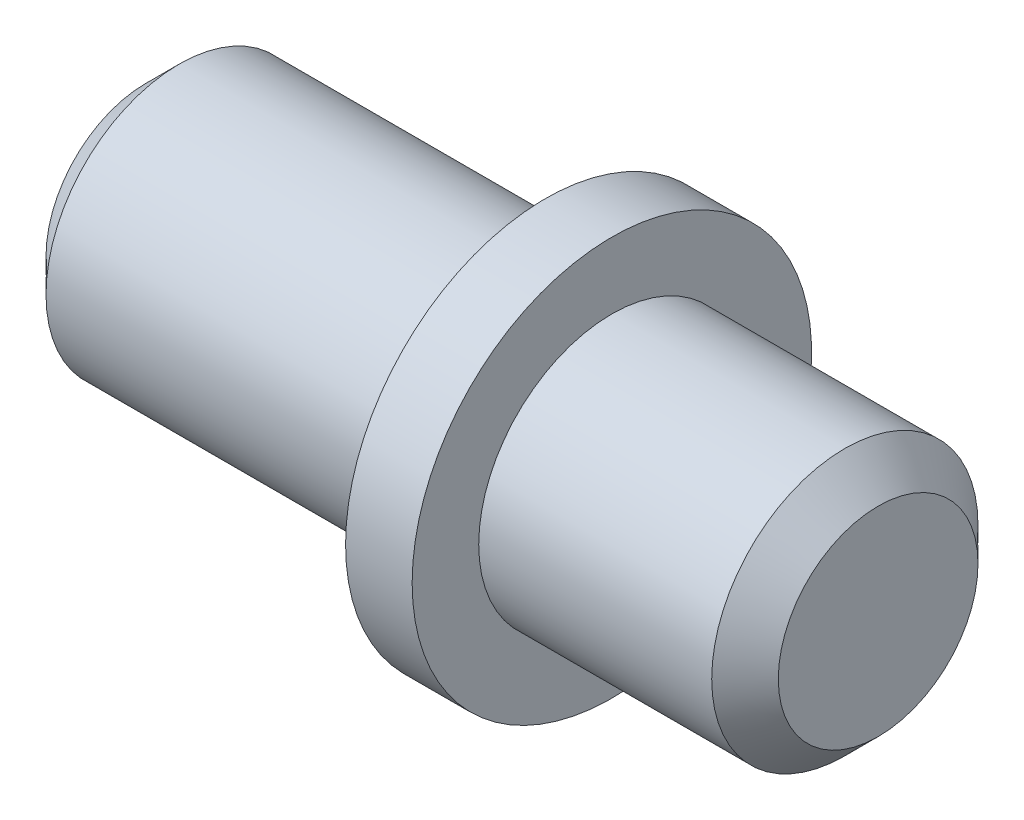
ISO-10303-21;
HEADER;
FILE_DESCRIPTION(('STEP AP214'),'2;1');
FILE_NAME('part.step','',(''),(''),'','','');
FILE_SCHEMA(('AUTOMOTIVE_DESIGN { 1 0 10303 214 1 1 1 1 }'));
ENDSEC;
DATA;
#1=APPLICATION_CONTEXT('core data for automotive mechanical design processes');
#2=APPLICATION_PROTOCOL_DEFINITION('international standard','automotive_design',2000,#1);
#3=PRODUCT_CONTEXT('',#1,'mechanical');
#4=PRODUCT('Part','Part','',(#3));
#5=PRODUCT_RELATED_PRODUCT_CATEGORY('part','',(#4));
#6=PRODUCT_DEFINITION_FORMATION('','',#4);
#7=PRODUCT_DEFINITION_CONTEXT('part definition',#1,'design');
#8=PRODUCT_DEFINITION('design','',#6,#7);
#9=PRODUCT_DEFINITION_SHAPE('','',#8);
#10=(LENGTH_UNIT() NAMED_UNIT(*) SI_UNIT(.MILLI.,.METRE.));
#11=(NAMED_UNIT(*) PLANE_ANGLE_UNIT() SI_UNIT($,.RADIAN.));
#12=(NAMED_UNIT(*) SI_UNIT($,.STERADIAN.) SOLID_ANGLE_UNIT());
#13=UNCERTAINTY_MEASURE_WITH_UNIT(LENGTH_MEASURE(1.E-05),#10,'distance_accuracy_value','');
#14=(GEOMETRIC_REPRESENTATION_CONTEXT(3) GLOBAL_UNCERTAINTY_ASSIGNED_CONTEXT((#13)) GLOBAL_UNIT_ASSIGNED_CONTEXT((#10,
#11,#12)) REPRESENTATION_CONTEXT('',''));
#15=CARTESIAN_POINT('',(0.,0.,0.));
#16=DIRECTION('',(0.,0.,1.));
#17=DIRECTION('',(1.,0.,0.));
#18=AXIS2_PLACEMENT_3D('',#15,#16,#17);
#19=CARTESIAN_POINT('',(0.,0.,0.));
#20=DIRECTION('',(-1.,0.,0.));
#21=DIRECTION('',(0.,0.,1.));
#22=AXIS2_PLACEMENT_3D('',#19,#20,#21);
#23=PLANE('',#22);
#24=CARTESIAN_POINT('',(0.,0.,0.));
#25=DIRECTION('',(-1.,0.,0.));
#26=DIRECTION('',(0.,0.,1.));
#27=AXIS2_PLACEMENT_3D('',#24,#25,#26);
#28=CIRCLE('',#27,1.5);
#29=CARTESIAN_POINT('',(0.,0.,1.5));
#30=VERTEX_POINT('',#29);
#31=EDGE_CURVE('E35',#30,#30,#28,.F.);
#32=ORIENTED_EDGE('',*,*,#31,.T.);
#33=EDGE_LOOP('',(#32));
#34=FACE_BOUND('',#33,.T.);
#35=ADVANCED_FACE('F25',(#34),#23,.F.);
#36=CARTESIAN_POINT('',(0.,0.,0.));
#37=DIRECTION('',(-1.,0.,0.));
#38=DIRECTION('',(0.,0.,1.));
#39=AXIS2_PLACEMENT_3D('',#36,#37,#38);
#40=CYLINDRICAL_SURFACE('',#39,2.);
#41=CARTESIAN_POINT('',(-0.5,0.,0.));
#42=DIRECTION('',(-1.,0.,0.));
#43=DIRECTION('',(0.,0.,1.));
#44=AXIS2_PLACEMENT_3D('',#41,#42,#43);
#45=CIRCLE('',#44,2.);
#46=CARTESIAN_POINT('',(-0.5,0.,2.));
#47=VERTEX_POINT('',#46);
#48=EDGE_CURVE('E39',#47,#47,#45,.T.);
#49=ORIENTED_EDGE('',*,*,#48,.T.);
#50=EDGE_LOOP('',(#49));
#51=FACE_BOUND('',#50,.T.);
#52=CARTESIAN_POINT('',(-4.,0.,0.));
#53=DIRECTION('',(-1.,0.,0.));
#54=DIRECTION('',(0.,0.,1.));
#55=AXIS2_PLACEMENT_3D('',#52,#53,#54);
#56=CIRCLE('',#55,2.);
#57=CARTESIAN_POINT('',(-4.,0.,2.));
#58=VERTEX_POINT('',#57);
#59=EDGE_CURVE('E44',#58,#58,#56,.T.);
#60=ORIENTED_EDGE('',*,*,#59,.F.);
#61=EDGE_LOOP('',(#60));
#62=FACE_BOUND('',#61,.T.);
#63=ADVANCED_FACE('F74',(#51,#62),#40,.T.);
#64=CARTESIAN_POINT('',(-4.,2.,0.));
#65=DIRECTION('',(-1.,0.,0.));
#66=DIRECTION('',(0.,0.,1.));
#67=AXIS2_PLACEMENT_3D('',#64,#65,#66);
#68=PLANE('',#67);
#69=CARTESIAN_POINT('',(-4.,0.,0.));
#70=DIRECTION('',(-1.,0.,0.));
#71=DIRECTION('',(0.,0.,1.));
#72=AXIS2_PLACEMENT_3D('',#69,#70,#71);
#73=CIRCLE('',#72,3.);
#74=CARTESIAN_POINT('',(-4.,0.,3.));
#75=VERTEX_POINT('',#74);
#76=EDGE_CURVE('E47',#75,#75,#73,.T.);
#77=ORIENTED_EDGE('',*,*,#76,.F.);
#78=EDGE_LOOP('',(#77));
#79=FACE_BOUND('',#78,.T.);
#80=ORIENTED_EDGE('',*,*,#59,.T.);
#81=EDGE_LOOP('',(#80));
#82=FACE_BOUND('',#81,.T.);
#83=ADVANCED_FACE('F68',(#79,#82),#68,.F.);
#84=CARTESIAN_POINT('',(0.,0.,0.));
#85=DIRECTION('',(-1.,0.,0.));
#86=DIRECTION('',(0.,0.,1.));
#87=AXIS2_PLACEMENT_3D('',#84,#85,#86);
#88=CYLINDRICAL_SURFACE('',#87,3.);
#89=CARTESIAN_POINT('',(-5.,0.,0.));
#90=DIRECTION('',(-1.,0.,0.));
#91=DIRECTION('',(0.,0.,1.));
#92=AXIS2_PLACEMENT_3D('',#89,#90,#91);
#93=CIRCLE('',#92,3.);
#94=CARTESIAN_POINT('',(-5.,0.,3.));
#95=VERTEX_POINT('',#94);
#96=EDGE_CURVE('E50',#95,#95,#93,.T.);
#97=ORIENTED_EDGE('',*,*,#96,.F.);
#98=EDGE_LOOP('',(#97));
#99=FACE_BOUND('',#98,.T.);
#100=ORIENTED_EDGE('',*,*,#76,.T.);
#101=EDGE_LOOP('',(#100));
#102=FACE_BOUND('',#101,.T.);
#103=ADVANCED_FACE('F62',(#99,#102),#88,.T.);
#104=CARTESIAN_POINT('',(-5.,3.,0.));
#105=DIRECTION('',(1.,0.,0.));
#106=DIRECTION('',(0.,0.,-1.));
#107=AXIS2_PLACEMENT_3D('',#104,#105,#106);
#108=PLANE('',#107);
#109=CARTESIAN_POINT('',(-5.,0.,0.));
#110=DIRECTION('',(-1.,0.,0.));
#111=DIRECTION('',(0.,0.,1.));
#112=AXIS2_PLACEMENT_3D('',#109,#110,#111);
#113=CIRCLE('',#112,2.);
#114=CARTESIAN_POINT('',(-5.,0.,2.));
#115=VERTEX_POINT('',#114);
#116=EDGE_CURVE('E53',#115,#115,#113,.T.);
#117=ORIENTED_EDGE('',*,*,#116,.F.);
#118=EDGE_LOOP('',(#117));
#119=FACE_BOUND('',#118,.T.);
#120=ORIENTED_EDGE('',*,*,#96,.T.);
#121=EDGE_LOOP('',(#120));
#122=FACE_BOUND('',#121,.T.);
#123=ADVANCED_FACE('F59',(#119,#122),#108,.F.);
#124=CARTESIAN_POINT('',(0.,0.,0.));
#125=DIRECTION('',(-1.,0.,0.));
#126=DIRECTION('',(0.,0.,1.));
#127=AXIS2_PLACEMENT_3D('',#124,#125,#126);
#128=CYLINDRICAL_SURFACE('',#127,2.);
#129=CARTESIAN_POINT('',(-10.5,0.,0.));
#130=DIRECTION('',(1.,0.,0.));
#131=DIRECTION('',(0.,0.,-1.));
#132=AXIS2_PLACEMENT_3D('',#129,#130,#131);
#133=CIRCLE('',#132,2.);
#134=CARTESIAN_POINT('',(-10.5,0.,-2.));
#135=VERTEX_POINT('',#134);
#136=EDGE_CURVE('E10',#135,#135,#133,.T.);
#137=ORIENTED_EDGE('',*,*,#136,.T.);
#138=EDGE_LOOP('',(#137));
#139=FACE_BOUND('',#138,.T.);
#140=ORIENTED_EDGE('',*,*,#116,.T.);
#141=EDGE_LOOP('',(#140));
#142=FACE_BOUND('',#141,.T.);
#143=ADVANCED_FACE('F57',(#139,#142),#128,.T.);
#144=CARTESIAN_POINT('',(-11.,2.,0.));
#145=DIRECTION('',(1.,0.,0.));
#146=DIRECTION('',(0.,0.,-1.));
#147=AXIS2_PLACEMENT_3D('',#144,#145,#146);
#148=PLANE('',#147);
#149=CARTESIAN_POINT('',(-11.,0.,0.));
#150=DIRECTION('',(1.,0.,0.));
#151=DIRECTION('',(0.,0.,-1.));
#152=AXIS2_PLACEMENT_3D('',#149,#150,#151);
#153=CIRCLE('',#152,1.5);
#154=CARTESIAN_POINT('',(-11.,0.,-1.5));
#155=VERTEX_POINT('',#154);
#156=EDGE_CURVE('E31',#155,#155,#153,.F.);
#157=ORIENTED_EDGE('',*,*,#156,.T.);
#158=EDGE_LOOP('',(#157));
#159=FACE_BOUND('',#158,.T.);
#160=ADVANCED_FACE('F87',(#159),#148,.F.);
#161=CARTESIAN_POINT('',(-0.5,0.,0.));
#162=DIRECTION('',(-1.,0.,0.));
#163=DIRECTION('',(0.,0.,1.));
#164=AXIS2_PLACEMENT_3D('',#161,#162,#163);
#165=CONICAL_SURFACE('',#164,2.,0.78539816339745);
#166=ORIENTED_EDGE('',*,*,#31,.F.);
#167=EDGE_LOOP('',(#166));
#168=FACE_BOUND('',#167,.T.);
#169=ORIENTED_EDGE('',*,*,#48,.F.);
#170=EDGE_LOOP('',(#169));
#171=FACE_BOUND('',#170,.T.);
#172=ADVANCED_FACE('F90',(#168,#171),#165,.T.);
#173=CARTESIAN_POINT('',(-11.,0.,0.));
#174=DIRECTION('',(1.,0.,0.));
#175=DIRECTION('',(0.,0.,-1.));
#176=AXIS2_PLACEMENT_3D('',#173,#174,#175);
#177=CONICAL_SURFACE('',#176,1.5,0.785398163397445);
#178=ORIENTED_EDGE('',*,*,#136,.F.);
#179=EDGE_LOOP('',(#178));
#180=FACE_BOUND('',#179,.T.);
#181=ORIENTED_EDGE('',*,*,#156,.F.);
#182=EDGE_LOOP('',(#181));
#183=FACE_BOUND('',#182,.T.);
#184=ADVANCED_FACE('F93',(#180,#183),#177,.T.);
#185=CLOSED_SHELL('',(#35,#63,#83,#103,#123,#143,#160,#172,#184));
#186=MANIFOLD_SOLID_BREP('B2',#185);
#187=ADVANCED_BREP_SHAPE_REPRESENTATION('',(#18,#186),#14);
#188=SHAPE_DEFINITION_REPRESENTATION(#9,#187);
ENDSEC;
END-ISO-10303-21;
